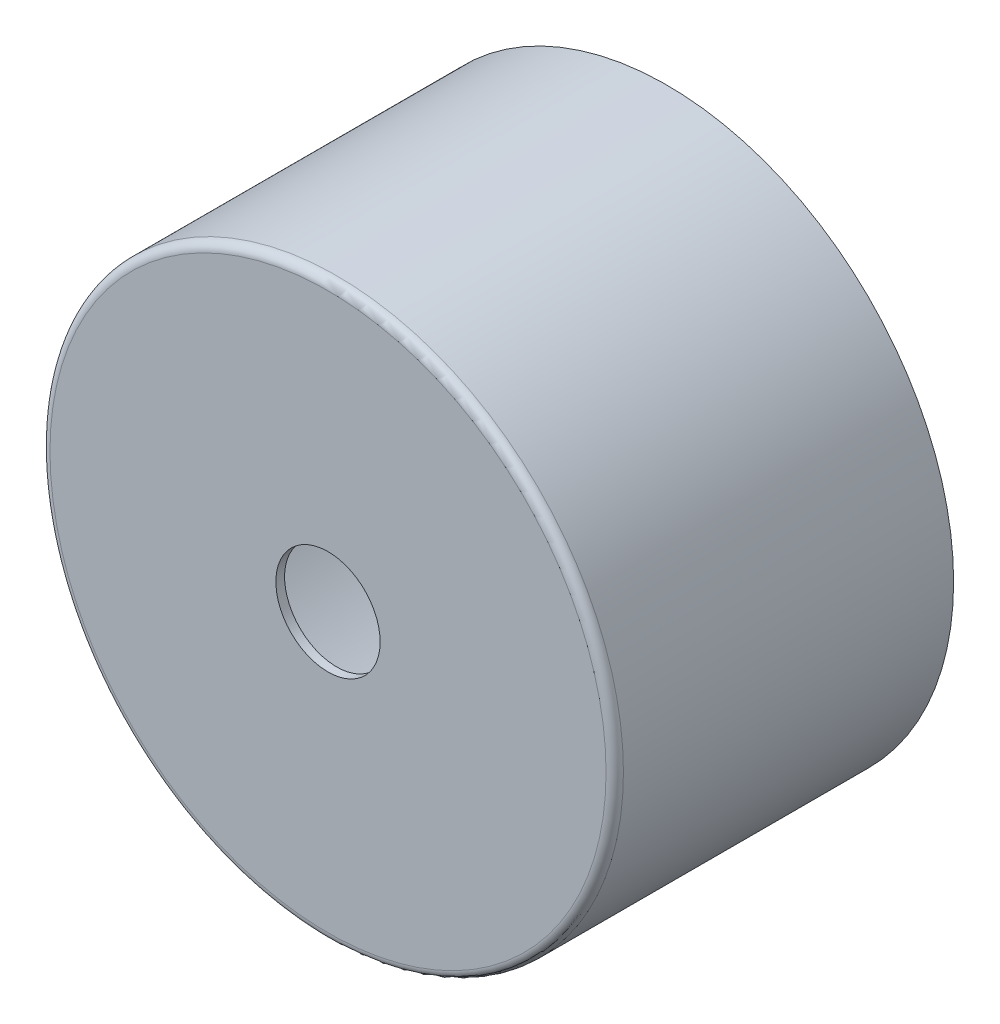
ISO-10303-21;
HEADER;
FILE_DESCRIPTION(('STEP AP214'),'2;1');
FILE_NAME('part.step','',(''),(''),'','','');
FILE_SCHEMA(('AUTOMOTIVE_DESIGN { 1 0 10303 214 1 1 1 1 }'));
ENDSEC;
DATA;
#1=APPLICATION_CONTEXT('core data for automotive mechanical design processes');
#2=APPLICATION_PROTOCOL_DEFINITION('international standard','automotive_design',2000,#1);
#3=PRODUCT_CONTEXT('',#1,'mechanical');
#4=PRODUCT('Part','Part','',(#3));
#5=PRODUCT_RELATED_PRODUCT_CATEGORY('part','',(#4));
#6=PRODUCT_DEFINITION_FORMATION('','',#4);
#7=PRODUCT_DEFINITION_CONTEXT('part definition',#1,'design');
#8=PRODUCT_DEFINITION('design','',#6,#7);
#9=PRODUCT_DEFINITION_SHAPE('','',#8);
#10=(LENGTH_UNIT() NAMED_UNIT(*) SI_UNIT(.MILLI.,.METRE.));
#11=(NAMED_UNIT(*) PLANE_ANGLE_UNIT() SI_UNIT($,.RADIAN.));
#12=(NAMED_UNIT(*) SI_UNIT($,.STERADIAN.) SOLID_ANGLE_UNIT());
#13=UNCERTAINTY_MEASURE_WITH_UNIT(LENGTH_MEASURE(1.E-05),#10,'distance_accuracy_value','');
#14=(GEOMETRIC_REPRESENTATION_CONTEXT(3) GLOBAL_UNCERTAINTY_ASSIGNED_CONTEXT((#13)) GLOBAL_UNIT_ASSIGNED_CONTEXT((#10,
#11,#12)) REPRESENTATION_CONTEXT('',''));
#15=CARTESIAN_POINT('',(0.,0.,0.));
#16=DIRECTION('',(0.,0.,1.));
#17=DIRECTION('',(1.,0.,0.));
#18=AXIS2_PLACEMENT_3D('',#15,#16,#17);
#19=CARTESIAN_POINT('',(0.,0.,-19.5));
#20=DIRECTION('',(0.,0.,1.));
#21=DIRECTION('',(1.,0.,0.));
#22=AXIS2_PLACEMENT_3D('',#19,#20,#21);
#23=CYLINDRICAL_SURFACE('',#22,16.5);
#24=CARTESIAN_POINT('',(0.,0.,-0.5));
#25=DIRECTION('',(0.,0.,1.));
#26=DIRECTION('',(1.,0.,0.));
#27=AXIS2_PLACEMENT_3D('',#24,#25,#26);
#28=CIRCLE('',#27,16.5);
#29=CARTESIAN_POINT('',(16.5,0.,-0.5));
#30=VERTEX_POINT('',#29);
#31=EDGE_CURVE('E10',#30,#30,#28,.F.);
#32=ORIENTED_EDGE('',*,*,#31,.T.);
#33=EDGE_LOOP('',(#32));
#34=FACE_BOUND('',#33,.T.);
#35=CARTESIAN_POINT('',(0.,0.,-19.5));
#36=DIRECTION('',(0.,0.,1.));
#37=DIRECTION('',(1.,0.,0.));
#38=AXIS2_PLACEMENT_3D('',#35,#36,#37);
#39=CIRCLE('',#38,16.5);
#40=CARTESIAN_POINT('',(16.5,0.,-19.5));
#41=VERTEX_POINT('',#40);
#42=EDGE_CURVE('E46',#41,#41,#39,.T.);
#43=ORIENTED_EDGE('',*,*,#42,.T.);
#44=EDGE_LOOP('',(#43));
#45=FACE_BOUND('',#44,.T.);
#46=ADVANCED_FACE('F35',(#34,#45),#23,.T.);
#47=CARTESIAN_POINT('',(0.,0.,-19.5));
#48=DIRECTION('',(0.,0.,1.));
#49=DIRECTION('',(1.,0.,0.));
#50=AXIS2_PLACEMENT_3D('',#47,#48,#49);
#51=PLANE('',#50);
#52=CARTESIAN_POINT('',(0.,0.,-19.5));
#53=DIRECTION('',(0.,0.,1.));
#54=DIRECTION('',(1.,0.,0.));
#55=AXIS2_PLACEMENT_3D('',#52,#53,#54);
#56=CIRCLE('',#55,16.);
#57=CARTESIAN_POINT('',(16.,0.,-19.5));
#58=VERTEX_POINT('',#57);
#59=EDGE_CURVE('E50',#58,#58,#56,.T.);
#60=ORIENTED_EDGE('',*,*,#59,.T.);
#61=EDGE_LOOP('',(#60));
#62=FACE_BOUND('',#61,.T.);
#63=ORIENTED_EDGE('',*,*,#42,.F.);
#64=EDGE_LOOP('',(#63));
#65=FACE_BOUND('',#64,.T.);
#66=ADVANCED_FACE('F71',(#62,#65),#51,.F.);
#67=CARTESIAN_POINT('',(0.,0.,0.));
#68=DIRECTION('',(0.,0.,1.));
#69=DIRECTION('',(1.,0.,0.));
#70=AXIS2_PLACEMENT_3D('',#67,#68,#69);
#71=PLANE('',#70);
#72=CARTESIAN_POINT('',(0.,0.,0.));
#73=DIRECTION('',(0.,0.,1.));
#74=DIRECTION('',(1.,0.,0.));
#75=AXIS2_PLACEMENT_3D('',#72,#73,#74);
#76=CIRCLE('',#75,16.);
#77=CARTESIAN_POINT('',(16.,0.,0.));
#78=VERTEX_POINT('',#77);
#79=EDGE_CURVE('E42',#78,#78,#76,.T.);
#80=ORIENTED_EDGE('',*,*,#79,.T.);
#81=EDGE_LOOP('',(#80));
#82=FACE_BOUND('',#81,.T.);
#83=CARTESIAN_POINT('',(0.,0.,0.));
#84=DIRECTION('',(0.,0.,1.));
#85=DIRECTION('',(1.,0.,0.));
#86=AXIS2_PLACEMENT_3D('',#83,#84,#85);
#87=CIRCLE('',#86,3.);
#88=CARTESIAN_POINT('',(3.,0.,0.));
#89=VERTEX_POINT('',#88);
#90=EDGE_CURVE('E56',#89,#89,#87,.T.);
#91=ORIENTED_EDGE('',*,*,#90,.F.);
#92=EDGE_LOOP('',(#91));
#93=FACE_BOUND('',#92,.T.);
#94=ADVANCED_FACE('F68',(#82,#93),#71,.T.);
#95=CARTESIAN_POINT('',(0.,0.,-19.5));
#96=DIRECTION('',(0.,0.,1.));
#97=DIRECTION('',(1.,0.,0.));
#98=AXIS2_PLACEMENT_3D('',#95,#96,#97);
#99=CYLINDRICAL_SURFACE('',#98,16.);
#100=ORIENTED_EDGE('',*,*,#59,.F.);
#101=EDGE_LOOP('',(#100));
#102=FACE_BOUND('',#101,.T.);
#103=CARTESIAN_POINT('',(0.,0.,-0.5));
#104=DIRECTION('',(0.,0.,1.));
#105=DIRECTION('',(1.,0.,0.));
#106=AXIS2_PLACEMENT_3D('',#103,#104,#105);
#107=CIRCLE('',#106,16.);
#108=CARTESIAN_POINT('',(16.,0.,-0.5));
#109=VERTEX_POINT('',#108);
#110=EDGE_CURVE('E55',#109,#109,#107,.T.);
#111=ORIENTED_EDGE('',*,*,#110,.T.);
#112=EDGE_LOOP('',(#111));
#113=FACE_BOUND('',#112,.T.);
#114=ADVANCED_FACE('F70',(#102,#113),#99,.F.);
#115=CARTESIAN_POINT('',(0.,0.,-0.5));
#116=DIRECTION('',(0.,0.,1.));
#117=DIRECTION('',(1.,0.,0.));
#118=AXIS2_PLACEMENT_3D('',#115,#116,#117);
#119=PLANE('',#118);
#120=CARTESIAN_POINT('',(0.,0.,-0.5));
#121=DIRECTION('',(0.,0.,1.));
#122=DIRECTION('',(1.,0.,0.));
#123=AXIS2_PLACEMENT_3D('',#120,#121,#122);
#124=CIRCLE('',#123,3.);
#125=CARTESIAN_POINT('',(3.,0.,-0.5));
#126=VERTEX_POINT('',#125);
#127=EDGE_CURVE('E53',#126,#126,#124,.T.);
#128=ORIENTED_EDGE('',*,*,#127,.T.);
#129=EDGE_LOOP('',(#128));
#130=FACE_BOUND('',#129,.T.);
#131=ORIENTED_EDGE('',*,*,#110,.F.);
#132=EDGE_LOOP('',(#131));
#133=FACE_BOUND('',#132,.T.);
#134=ADVANCED_FACE('F77',(#130,#133),#119,.F.);
#135=CARTESIAN_POINT('',(0.,0.,-19.5));
#136=DIRECTION('',(0.,0.,1.));
#137=DIRECTION('',(1.,0.,0.));
#138=AXIS2_PLACEMENT_3D('',#135,#136,#137);
#139=CYLINDRICAL_SURFACE('',#138,3.);
#140=ORIENTED_EDGE('',*,*,#90,.T.);
#141=EDGE_LOOP('',(#140));
#142=FACE_BOUND('',#141,.T.);
#143=ORIENTED_EDGE('',*,*,#127,.F.);
#144=EDGE_LOOP('',(#143));
#145=FACE_BOUND('',#144,.T.);
#146=ADVANCED_FACE('F65',(#142,#145),#139,.F.);
#147=CARTESIAN_POINT('',(0.,0.,-0.5));
#148=DIRECTION('',(0.,0.,1.));
#149=DIRECTION('',(1.,0.,0.));
#150=AXIS2_PLACEMENT_3D('',#147,#148,#149);
#151=TOROIDAL_SURFACE('',#150,16.,0.5);
#152=ORIENTED_EDGE('',*,*,#31,.F.);
#153=EDGE_LOOP('',(#152));
#154=FACE_BOUND('',#153,.T.);
#155=ORIENTED_EDGE('',*,*,#79,.F.);
#156=EDGE_LOOP('',(#155));
#157=FACE_BOUND('',#156,.T.);
#158=ADVANCED_FACE('F37',(#154,#157),#151,.T.);
#159=CLOSED_SHELL('',(#46,#66,#94,#114,#134,#146,#158));
#160=MANIFOLD_SOLID_BREP('B2',#159);
#161=ADVANCED_BREP_SHAPE_REPRESENTATION('',(#18,#160),#14);
#162=SHAPE_DEFINITION_REPRESENTATION(#9,#161);
ENDSEC;
END-ISO-10303-21;
